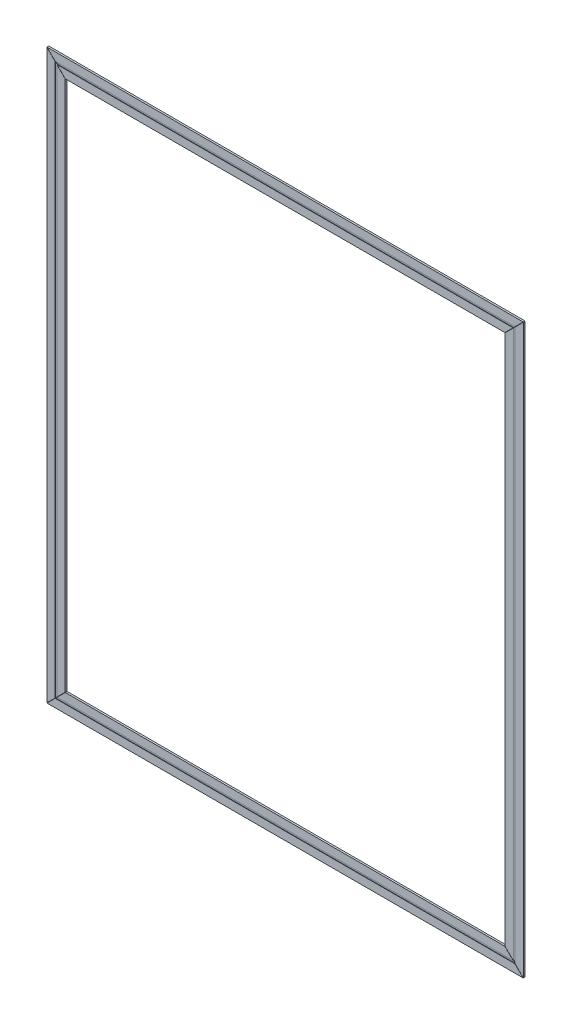
ISO-10303-21;
HEADER;
FILE_DESCRIPTION(('STEP AP214'),'2;1');
FILE_NAME('part.step','',(''),(''),'','','');
FILE_SCHEMA(('AUTOMOTIVE_DESIGN { 1 0 10303 214 1 1 1 1 }'));
ENDSEC;
DATA;
#1=APPLICATION_CONTEXT('core data for automotive mechanical design processes');
#2=APPLICATION_PROTOCOL_DEFINITION('international standard','automotive_design',2000,#1);
#3=PRODUCT_CONTEXT('',#1,'mechanical');
#4=PRODUCT('Part','Part','',(#3));
#5=PRODUCT_RELATED_PRODUCT_CATEGORY('part','',(#4));
#6=PRODUCT_DEFINITION_FORMATION('','',#4);
#7=PRODUCT_DEFINITION_CONTEXT('part definition',#1,'design');
#8=PRODUCT_DEFINITION('design','',#6,#7);
#9=PRODUCT_DEFINITION_SHAPE('','',#8);
#10=(LENGTH_UNIT() NAMED_UNIT(*) SI_UNIT(.MILLI.,.METRE.));
#11=(NAMED_UNIT(*) PLANE_ANGLE_UNIT() SI_UNIT($,.RADIAN.));
#12=(NAMED_UNIT(*) SI_UNIT($,.STERADIAN.) SOLID_ANGLE_UNIT());
#13=UNCERTAINTY_MEASURE_WITH_UNIT(LENGTH_MEASURE(1.E-05),#10,'distance_accuracy_value','');
#14=(GEOMETRIC_REPRESENTATION_CONTEXT(3) GLOBAL_UNCERTAINTY_ASSIGNED_CONTEXT((#13)) GLOBAL_UNIT_ASSIGNED_CONTEXT((#10,
#11,#12)) REPRESENTATION_CONTEXT('',''));
#15=CARTESIAN_POINT('',(0.,0.,0.));
#16=DIRECTION('',(0.,0.,1.));
#17=DIRECTION('',(1.,0.,0.));
#18=AXIS2_PLACEMENT_3D('',#15,#16,#17);
#19=CARTESIAN_POINT('',(0.,0.,2.));
#20=DIRECTION('',(0.,0.,1.));
#21=DIRECTION('',(1.,0.,0.));
#22=AXIS2_PLACEMENT_3D('',#19,#20,#21);
#23=PLANE('',#22);
#24=DIRECTION('',(0.707106781186552,0.707106781186543,0.));
#25=VECTOR('',#24,1.);
#26=CARTESIAN_POINT('',(-259.8,-310.,2.));
#27=LINE('',#26,#25);
#28=CARTESIAN_POINT('',(-259.8,-310.,2.));
#29=VERTEX_POINT('',#28);
#30=CARTESIAN_POINT('',(-250.8,-301.,2.));
#31=VERTEX_POINT('',#30);
#32=EDGE_CURVE('E124',#29,#31,#27,.T.);
#33=ORIENTED_EDGE('',*,*,#32,.F.);
#34=DIRECTION('',(1.,0.,0.));
#35=VECTOR('',#34,1.);
#36=CARTESIAN_POINT('',(0.,-310.,2.));
#37=LINE('',#36,#35);
#38=CARTESIAN_POINT('',(259.8,-310.,2.));
#39=VERTEX_POINT('',#38);
#40=EDGE_CURVE('E136',#29,#39,#37,.T.);
#41=ORIENTED_EDGE('',*,*,#40,.T.);
#42=DIRECTION('',(0.707106781186552,-0.707106781186543,0.));
#43=VECTOR('',#42,1.);
#44=CARTESIAN_POINT('',(259.8,-310.,2.));
#45=LINE('',#44,#43);
#46=CARTESIAN_POINT('',(250.8,-301.,2.));
#47=VERTEX_POINT('',#46);
#48=EDGE_CURVE('E130',#47,#39,#45,.T.);
#49=ORIENTED_EDGE('',*,*,#48,.F.);
#50=DIRECTION('',(-1.,0.,0.));
#51=VECTOR('',#50,1.);
#52=CARTESIAN_POINT('',(0.,-301.,2.));
#53=LINE('',#52,#51);
#54=EDGE_CURVE('E138',#47,#31,#53,.T.);
#55=ORIENTED_EDGE('',*,*,#54,.T.);
#56=EDGE_LOOP('',(#33,#41,#49,#55));
#57=FACE_BOUND('',#56,.T.);
#58=ADVANCED_FACE('F70',(#57),#23,.T.);
#59=CARTESIAN_POINT('',(0.,0.,0.));
#60=DIRECTION('',(0.,0.,1.));
#61=DIRECTION('',(1.,0.,0.));
#62=AXIS2_PLACEMENT_3D('',#59,#60,#61);
#63=PLANE('',#62);
#64=DIRECTION('',(1.,0.,0.));
#65=VECTOR('',#64,1.);
#66=CARTESIAN_POINT('',(0.,-310.,0.));
#67=LINE('',#66,#65);
#68=CARTESIAN_POINT('',(-259.8,-310.,0.));
#69=VERTEX_POINT('',#68);
#70=CARTESIAN_POINT('',(259.8,-310.,0.));
#71=VERTEX_POINT('',#70);
#72=EDGE_CURVE('E151',#69,#71,#67,.T.);
#73=ORIENTED_EDGE('',*,*,#72,.F.);
#74=DIRECTION('',(0.707106781186552,0.707106781186543,0.));
#75=VECTOR('',#74,1.);
#76=CARTESIAN_POINT('',(25.1000000000016,-25.100000000002,0.));
#77=LINE('',#76,#75);
#78=CARTESIAN_POINT('',(-239.8,-290.,0.));
#79=VERTEX_POINT('',#78);
#80=EDGE_CURVE('E89',#69,#79,#77,.T.);
#81=ORIENTED_EDGE('',*,*,#80,.T.);
#82=DIRECTION('',(1.,0.,0.));
#83=VECTOR('',#82,1.);
#84=CARTESIAN_POINT('',(0.,-290.,0.));
#85=LINE('',#84,#83);
#86=CARTESIAN_POINT('',(239.8,-290.,0.));
#87=VERTEX_POINT('',#86);
#88=EDGE_CURVE('E157',#79,#87,#85,.T.);
#89=ORIENTED_EDGE('',*,*,#88,.T.);
#90=DIRECTION('',(0.707106781186552,-0.707106781186543,0.));
#91=VECTOR('',#90,1.);
#92=CARTESIAN_POINT('',(-25.1000000000016,-25.100000000002,0.));
#93=LINE('',#92,#91);
#94=EDGE_CURVE('E152',#87,#71,#93,.T.);
#95=ORIENTED_EDGE('',*,*,#94,.T.);
#96=EDGE_LOOP('',(#73,#81,#89,#95));
#97=FACE_BOUND('',#96,.T.);
#98=ADVANCED_FACE('F72',(#97),#63,.F.);
#99=CARTESIAN_POINT('',(0.,0.,1.5));
#100=DIRECTION('',(0.,0.,1.));
#101=DIRECTION('',(1.,0.,0.));
#102=AXIS2_PLACEMENT_3D('',#99,#100,#101);
#103=PLANE('',#102);
#104=DIRECTION('',(0.707106781186552,0.707106781186543,0.));
#105=VECTOR('',#104,1.);
#106=CARTESIAN_POINT('',(25.1000000000016,-25.100000000002,1.5));
#107=LINE('',#106,#105);
#108=CARTESIAN_POINT('',(-250.8,-301.,1.5));
#109=VERTEX_POINT('',#108);
#110=CARTESIAN_POINT('',(-248.8,-299.,1.5));
#111=VERTEX_POINT('',#110);
#112=EDGE_CURVE('E139',#109,#111,#107,.T.);
#113=ORIENTED_EDGE('',*,*,#112,.F.);
#114=DIRECTION('',(-1.,0.,0.));
#115=VECTOR('',#114,1.);
#116=CARTESIAN_POINT('',(0.,-301.,1.5));
#117=LINE('',#116,#115);
#118=CARTESIAN_POINT('',(250.8,-301.,1.5));
#119=VERTEX_POINT('',#118);
#120=EDGE_CURVE('E153',#119,#109,#117,.T.);
#121=ORIENTED_EDGE('',*,*,#120,.F.);
#122=DIRECTION('',(0.707106781186552,-0.707106781186543,0.));
#123=VECTOR('',#122,1.);
#124=CARTESIAN_POINT('',(-25.1000000000016,-25.100000000002,1.5));
#125=LINE('',#124,#123);
#126=CARTESIAN_POINT('',(248.8,-299.,1.5));
#127=VERTEX_POINT('',#126);
#128=EDGE_CURVE('E179',#127,#119,#125,.T.);
#129=ORIENTED_EDGE('',*,*,#128,.F.);
#130=DIRECTION('',(-1.,0.,0.));
#131=VECTOR('',#130,1.);
#132=CARTESIAN_POINT('',(0.,-299.,1.5));
#133=LINE('',#132,#131);
#134=EDGE_CURVE('E148',#127,#111,#133,.T.);
#135=ORIENTED_EDGE('',*,*,#134,.T.);
#136=EDGE_LOOP('',(#113,#121,#129,#135));
#137=FACE_BOUND('',#136,.T.);
#138=ADVANCED_FACE('F210',(#137),#103,.T.);
#139=CARTESIAN_POINT('',(0.,0.,2.));
#140=DIRECTION('',(0.,0.,1.));
#141=DIRECTION('',(1.,0.,0.));
#142=AXIS2_PLACEMENT_3D('',#139,#140,#141);
#143=PLANE('',#142);
#144=DIRECTION('',(0.707106781186552,0.707106781186543,0.));
#145=VECTOR('',#144,1.);
#146=CARTESIAN_POINT('',(25.1000000000016,-25.100000000002,2.));
#147=LINE('',#146,#145);
#148=CARTESIAN_POINT('',(-248.8,-299.,2.));
#149=VERTEX_POINT('',#148);
#150=CARTESIAN_POINT('',(-239.8,-290.,2.));
#151=VERTEX_POINT('',#150);
#152=EDGE_CURVE('E13',#149,#151,#147,.T.);
#153=ORIENTED_EDGE('',*,*,#152,.F.);
#154=DIRECTION('',(-1.,0.,0.));
#155=VECTOR('',#154,1.);
#156=CARTESIAN_POINT('',(0.,-299.,2.));
#157=LINE('',#156,#155);
#158=CARTESIAN_POINT('',(248.8,-299.,2.));
#159=VERTEX_POINT('',#158);
#160=EDGE_CURVE('E165',#159,#149,#157,.T.);
#161=ORIENTED_EDGE('',*,*,#160,.F.);
#162=CARTESIAN_POINT('',(239.8,-290.,2.));
#163=VERTEX_POINT('',#162);
#164=EDGE_CURVE('E74',#163,#159,#45,.T.);
#165=ORIENTED_EDGE('',*,*,#164,.F.);
#166=DIRECTION('',(1.,0.,0.));
#167=VECTOR('',#166,1.);
#168=CARTESIAN_POINT('',(0.,-290.,2.));
#169=LINE('',#168,#167);
#170=EDGE_CURVE('E160',#151,#163,#169,.T.);
#171=ORIENTED_EDGE('',*,*,#170,.F.);
#172=EDGE_LOOP('',(#153,#161,#165,#171));
#173=FACE_BOUND('',#172,.T.);
#174=ADVANCED_FACE('F199',(#173),#143,.T.);
#175=CARTESIAN_POINT('',(0.,-310.,2.));
#176=DIRECTION('',(0.,1.,0.));
#177=DIRECTION('',(0.,0.,1.));
#178=AXIS2_PLACEMENT_3D('',#175,#176,#177);
#179=PLANE('',#178);
#180=ORIENTED_EDGE('',*,*,#40,.F.);
#181=DIRECTION('',(0.,0.,1.));
#182=VECTOR('',#181,1.);
#183=CARTESIAN_POINT('',(-259.8,-310.,-19.));
#184=LINE('',#183,#182);
#185=EDGE_CURVE('E120',#69,#29,#184,.T.);
#186=ORIENTED_EDGE('',*,*,#185,.F.);
#187=ORIENTED_EDGE('',*,*,#72,.T.);
#188=DIRECTION('',(0.,0.,1.));
#189=VECTOR('',#188,1.);
#190=CARTESIAN_POINT('',(259.8,-310.,-19.));
#191=LINE('',#190,#189);
#192=EDGE_CURVE('E143',#71,#39,#191,.T.);
#193=ORIENTED_EDGE('',*,*,#192,.T.);
#194=EDGE_LOOP('',(#180,#186,#187,#193));
#195=FACE_BOUND('',#194,.T.);
#196=ADVANCED_FACE('F142',(#195),#179,.F.);
#197=CARTESIAN_POINT('',(0.,-301.,2.));
#198=DIRECTION('',(0.,-1.,0.));
#199=DIRECTION('',(0.,0.,-1.));
#200=AXIS2_PLACEMENT_3D('',#197,#198,#199);
#201=PLANE('',#200);
#202=ORIENTED_EDGE('',*,*,#120,.T.);
#203=DIRECTION('',(0.,0.,1.));
#204=VECTOR('',#203,1.);
#205=CARTESIAN_POINT('',(-250.8,-301.,2.));
#206=LINE('',#205,#204);
#207=EDGE_CURVE('E156',#109,#31,#206,.T.);
#208=ORIENTED_EDGE('',*,*,#207,.T.);
#209=ORIENTED_EDGE('',*,*,#54,.F.);
#210=DIRECTION('',(0.,0.,-1.));
#211=VECTOR('',#210,1.);
#212=CARTESIAN_POINT('',(250.8,-301.,2.));
#213=LINE('',#212,#211);
#214=EDGE_CURVE('E168',#47,#119,#213,.T.);
#215=ORIENTED_EDGE('',*,*,#214,.T.);
#216=EDGE_LOOP('',(#202,#208,#209,#215));
#217=FACE_BOUND('',#216,.T.);
#218=ADVANCED_FACE('F203',(#217),#201,.F.);
#219=CARTESIAN_POINT('',(0.,-299.,2.));
#220=DIRECTION('',(0.,-1.,0.));
#221=DIRECTION('',(0.,0.,-1.));
#222=AXIS2_PLACEMENT_3D('',#219,#220,#221);
#223=PLANE('',#222);
#224=DIRECTION('',(0.,0.,1.));
#225=VECTOR('',#224,1.);
#226=CARTESIAN_POINT('',(-248.8,-299.,2.));
#227=LINE('',#226,#225);
#228=EDGE_CURVE('E80',#111,#149,#227,.T.);
#229=ORIENTED_EDGE('',*,*,#228,.F.);
#230=ORIENTED_EDGE('',*,*,#134,.F.);
#231=DIRECTION('',(0.,0.,-1.));
#232=VECTOR('',#231,1.);
#233=CARTESIAN_POINT('',(248.8,-299.,2.));
#234=LINE('',#233,#232);
#235=EDGE_CURVE('E181',#159,#127,#234,.T.);
#236=ORIENTED_EDGE('',*,*,#235,.F.);
#237=ORIENTED_EDGE('',*,*,#160,.T.);
#238=EDGE_LOOP('',(#229,#230,#236,#237));
#239=FACE_BOUND('',#238,.T.);
#240=ADVANCED_FACE('F214',(#239),#223,.T.);
#241=CARTESIAN_POINT('',(0.,-290.,2.));
#242=DIRECTION('',(0.,1.,0.));
#243=DIRECTION('',(0.,0.,1.));
#244=AXIS2_PLACEMENT_3D('',#241,#242,#243);
#245=PLANE('',#244);
#246=DIRECTION('',(0.,0.,1.));
#247=VECTOR('',#246,1.);
#248=CARTESIAN_POINT('',(-239.8,-290.,-19.));
#249=LINE('',#248,#247);
#250=EDGE_CURVE('E164',#79,#151,#249,.T.);
#251=ORIENTED_EDGE('',*,*,#250,.T.);
#252=ORIENTED_EDGE('',*,*,#170,.T.);
#253=DIRECTION('',(0.,0.,1.));
#254=VECTOR('',#253,1.);
#255=CARTESIAN_POINT('',(239.8,-290.,-19.));
#256=LINE('',#255,#254);
#257=EDGE_CURVE('E163',#87,#163,#256,.T.);
#258=ORIENTED_EDGE('',*,*,#257,.F.);
#259=ORIENTED_EDGE('',*,*,#88,.F.);
#260=EDGE_LOOP('',(#251,#252,#258,#259));
#261=FACE_BOUND('',#260,.T.);
#262=ADVANCED_FACE('F194',(#261),#245,.T.);
#263=CARTESIAN_POINT('',(259.8,-310.,-19.));
#264=DIRECTION('',(-0.707106781186543,-0.707106781186552,0.));
#265=DIRECTION('',(0.707106781186552,-0.707106781186543,0.));
#266=AXIS2_PLACEMENT_3D('',#263,#264,#265);
#267=PLANE('',#266);
#268=ORIENTED_EDGE('',*,*,#257,.T.);
#269=ORIENTED_EDGE('',*,*,#164,.T.);
#270=ORIENTED_EDGE('',*,*,#235,.T.);
#271=ORIENTED_EDGE('',*,*,#128,.T.);
#272=ORIENTED_EDGE('',*,*,#214,.F.);
#273=ORIENTED_EDGE('',*,*,#48,.T.);
#274=ORIENTED_EDGE('',*,*,#192,.F.);
#275=ORIENTED_EDGE('',*,*,#94,.F.);
#276=EDGE_LOOP('',(#268,#269,#270,#271,#272,#273,#274,#275));
#277=FACE_BOUND('',#276,.T.);
#278=ADVANCED_FACE('F190',(#277),#267,.F.);
#279=CARTESIAN_POINT('',(-259.8,-310.,-19.));
#280=DIRECTION('',(0.707106781186543,-0.707106781186552,0.));
#281=DIRECTION('',(0.707106781186552,0.707106781186543,0.));
#282=AXIS2_PLACEMENT_3D('',#279,#280,#281);
#283=PLANE('',#282);
#284=ORIENTED_EDGE('',*,*,#185,.T.);
#285=ORIENTED_EDGE('',*,*,#32,.T.);
#286=ORIENTED_EDGE('',*,*,#207,.F.);
#287=ORIENTED_EDGE('',*,*,#112,.T.);
#288=ORIENTED_EDGE('',*,*,#228,.T.);
#289=ORIENTED_EDGE('',*,*,#152,.T.);
#290=ORIENTED_EDGE('',*,*,#250,.F.);
#291=ORIENTED_EDGE('',*,*,#80,.F.);
#292=EDGE_LOOP('',(#284,#285,#286,#287,#288,#289,#290,#291));
#293=FACE_BOUND('',#292,.T.);
#294=ADVANCED_FACE('F122',(#293),#283,.F.);
#295=CLOSED_SHELL('',(#58,#98,#138,#174,#196,#218,#240,#262,#278,#294));
#296=MANIFOLD_SOLID_BREP('B2',#295);
#297=CARTESIAN_POINT('',(0.,0.,2.));
#298=DIRECTION('',(0.,0.,1.));
#299=DIRECTION('',(1.,0.,0.));
#300=AXIS2_PLACEMENT_3D('',#297,#298,#299);
#301=PLANE('',#300);
#302=DIRECTION('',(-0.707106781186551,-0.707106781186544,0.));
#303=VECTOR('',#302,1.);
#304=CARTESIAN_POINT('',(259.8,310.,2.));
#305=LINE('',#304,#303);
#306=CARTESIAN_POINT('',(259.8,310.,2.));
#307=VERTEX_POINT('',#306);
#308=CARTESIAN_POINT('',(250.8,301.,2.));
#309=VERTEX_POINT('',#308);
#310=EDGE_CURVE('E394',#307,#309,#305,.T.);
#311=ORIENTED_EDGE('',*,*,#310,.F.);
#312=DIRECTION('',(1.,0.,0.));
#313=VECTOR('',#312,1.);
#314=CARTESIAN_POINT('',(0.,310.,2.));
#315=LINE('',#314,#313);
#316=CARTESIAN_POINT('',(-259.8,310.,2.));
#317=VERTEX_POINT('',#316);
#318=EDGE_CURVE('E511',#317,#307,#315,.T.);
#319=ORIENTED_EDGE('',*,*,#318,.F.);
#320=DIRECTION('',(-0.707106781186551,0.707106781186544,0.));
#321=VECTOR('',#320,1.);
#322=CARTESIAN_POINT('',(-259.8,310.,2.));
#323=LINE('',#322,#321);
#324=CARTESIAN_POINT('',(-250.8,301.,2.));
#325=VERTEX_POINT('',#324);
#326=EDGE_CURVE('E499',#325,#317,#323,.T.);
#327=ORIENTED_EDGE('',*,*,#326,.F.);
#328=DIRECTION('',(-1.,0.,0.));
#329=VECTOR('',#328,1.);
#330=CARTESIAN_POINT('',(0.,301.,2.));
#331=LINE('',#330,#329);
#332=EDGE_CURVE('E508',#309,#325,#331,.T.);
#333=ORIENTED_EDGE('',*,*,#332,.F.);
#334=EDGE_LOOP('',(#311,#319,#327,#333));
#335=FACE_BOUND('',#334,.T.);
#336=ADVANCED_FACE('F391',(#335),#301,.T.);
#337=CARTESIAN_POINT('',(0.,0.,2.));
#338=DIRECTION('',(0.,0.,1.));
#339=DIRECTION('',(1.,0.,0.));
#340=AXIS2_PLACEMENT_3D('',#337,#338,#339);
#341=PLANE('',#340);
#342=DIRECTION('',(-0.707106781186551,-0.707106781186544,0.));
#343=VECTOR('',#342,1.);
#344=CARTESIAN_POINT('',(-25.1000000000014,25.1000000000016,2.));
#345=LINE('',#344,#343);
#346=CARTESIAN_POINT('',(248.8,299.,2.));
#347=VERTEX_POINT('',#346);
#348=CARTESIAN_POINT('',(239.8,290.,2.));
#349=VERTEX_POINT('',#348);
#350=EDGE_CURVE('E68',#347,#349,#345,.T.);
#351=ORIENTED_EDGE('',*,*,#350,.F.);
#352=DIRECTION('',(-1.,0.,0.));
#353=VECTOR('',#352,1.);
#354=CARTESIAN_POINT('',(0.,299.,2.));
#355=LINE('',#354,#353);
#356=CARTESIAN_POINT('',(-248.8,299.,2.));
#357=VERTEX_POINT('',#356);
#358=EDGE_CURVE('E489',#347,#357,#355,.T.);
#359=ORIENTED_EDGE('',*,*,#358,.T.);
#360=CARTESIAN_POINT('',(-239.8,290.,2.));
#361=VERTEX_POINT('',#360);
#362=EDGE_CURVE('E502',#361,#357,#323,.T.);
#363=ORIENTED_EDGE('',*,*,#362,.F.);
#364=DIRECTION('',(1.,0.,0.));
#365=VECTOR('',#364,1.);
#366=CARTESIAN_POINT('',(0.,290.,2.));
#367=LINE('',#366,#365);
#368=EDGE_CURVE('E486',#361,#349,#367,.T.);
#369=ORIENTED_EDGE('',*,*,#368,.T.);
#370=EDGE_LOOP('',(#351,#359,#363,#369));
#371=FACE_BOUND('',#370,.T.);
#372=ADVANCED_FACE('F525',(#371),#341,.T.);
#373=CARTESIAN_POINT('',(0.,299.,2.));
#374=DIRECTION('',(0.,-1.,0.));
#375=DIRECTION('',(0.,0.,-1.));
#376=AXIS2_PLACEMENT_3D('',#373,#374,#375);
#377=PLANE('',#376);
#378=ORIENTED_EDGE('',*,*,#358,.F.);
#379=DIRECTION('',(0.,0.,-1.));
#380=VECTOR('',#379,1.);
#381=CARTESIAN_POINT('',(248.8,299.,2.));
#382=LINE('',#381,#380);
#383=CARTESIAN_POINT('',(248.8,299.,1.5));
#384=VERTEX_POINT('',#383);
#385=EDGE_CURVE('E448',#347,#384,#382,.T.);
#386=ORIENTED_EDGE('',*,*,#385,.T.);
#387=DIRECTION('',(-1.,0.,0.));
#388=VECTOR('',#387,1.);
#389=CARTESIAN_POINT('',(0.,299.,1.5));
#390=LINE('',#389,#388);
#391=CARTESIAN_POINT('',(-248.8,299.,1.5));
#392=VERTEX_POINT('',#391);
#393=EDGE_CURVE('E469',#384,#392,#390,.T.);
#394=ORIENTED_EDGE('',*,*,#393,.T.);
#395=DIRECTION('',(0.,0.,1.));
#396=VECTOR('',#395,1.);
#397=CARTESIAN_POINT('',(-248.8,299.,2.));
#398=LINE('',#397,#396);
#399=EDGE_CURVE('E485',#392,#357,#398,.T.);
#400=ORIENTED_EDGE('',*,*,#399,.T.);
#401=EDGE_LOOP('',(#378,#386,#394,#400));
#402=FACE_BOUND('',#401,.T.);
#403=ADVANCED_FACE('F529',(#402),#377,.F.);
#404=CARTESIAN_POINT('',(0.,290.,2.));
#405=DIRECTION('',(0.,1.,0.));
#406=DIRECTION('',(0.,0.,1.));
#407=AXIS2_PLACEMENT_3D('',#404,#405,#406);
#408=PLANE('',#407);
#409=DIRECTION('',(1.,0.,0.));
#410=VECTOR('',#409,1.);
#411=CARTESIAN_POINT('',(0.,290.,0.));
#412=LINE('',#411,#410);
#413=CARTESIAN_POINT('',(-239.8,290.,0.));
#414=VERTEX_POINT('',#413);
#415=CARTESIAN_POINT('',(239.8,290.,0.));
#416=VERTEX_POINT('',#415);
#417=EDGE_CURVE('E479',#414,#416,#412,.T.);
#418=ORIENTED_EDGE('',*,*,#417,.T.);
#419=DIRECTION('',(0.,0.,1.));
#420=VECTOR('',#419,1.);
#421=CARTESIAN_POINT('',(239.8,290.,-19.));
#422=LINE('',#421,#420);
#423=EDGE_CURVE('E475',#416,#349,#422,.T.);
#424=ORIENTED_EDGE('',*,*,#423,.T.);
#425=ORIENTED_EDGE('',*,*,#368,.F.);
#426=DIRECTION('',(0.,0.,1.));
#427=VECTOR('',#426,1.);
#428=CARTESIAN_POINT('',(-239.8,290.,-19.));
#429=LINE('',#428,#427);
#430=EDGE_CURVE('E505',#414,#361,#429,.T.);
#431=ORIENTED_EDGE('',*,*,#430,.F.);
#432=EDGE_LOOP('',(#418,#424,#425,#431));
#433=FACE_BOUND('',#432,.T.);
#434=ADVANCED_FACE('F535',(#433),#408,.F.);
#435=CARTESIAN_POINT('',(0.,0.,1.5));
#436=DIRECTION('',(0.,0.,1.));
#437=DIRECTION('',(1.,0.,0.));
#438=AXIS2_PLACEMENT_3D('',#435,#436,#437);
#439=PLANE('',#438);
#440=DIRECTION('',(-0.707106781186551,-0.707106781186544,0.));
#441=VECTOR('',#440,1.);
#442=CARTESIAN_POINT('',(-25.1000000000014,25.1000000000016,1.5));
#443=LINE('',#442,#441);
#444=CARTESIAN_POINT('',(250.8,301.,1.5));
#445=VERTEX_POINT('',#444);
#446=EDGE_CURVE('E400',#445,#384,#443,.T.);
#447=ORIENTED_EDGE('',*,*,#446,.F.);
#448=DIRECTION('',(-1.,0.,0.));
#449=VECTOR('',#448,1.);
#450=CARTESIAN_POINT('',(0.,301.,1.5));
#451=LINE('',#450,#449);
#452=CARTESIAN_POINT('',(-250.8,301.,1.5));
#453=VERTEX_POINT('',#452);
#454=EDGE_CURVE('E467',#445,#453,#451,.T.);
#455=ORIENTED_EDGE('',*,*,#454,.T.);
#456=DIRECTION('',(-0.707106781186551,0.707106781186544,0.));
#457=VECTOR('',#456,1.);
#458=CARTESIAN_POINT('',(25.1000000000014,25.1000000000016,1.5));
#459=LINE('',#458,#457);
#460=EDGE_CURVE('E500',#392,#453,#459,.T.);
#461=ORIENTED_EDGE('',*,*,#460,.F.);
#462=ORIENTED_EDGE('',*,*,#393,.F.);
#463=EDGE_LOOP('',(#447,#455,#461,#462));
#464=FACE_BOUND('',#463,.T.);
#465=ADVANCED_FACE('F465',(#464),#439,.T.);
#466=CARTESIAN_POINT('',(0.,0.,0.));
#467=DIRECTION('',(0.,0.,1.));
#468=DIRECTION('',(1.,0.,0.));
#469=AXIS2_PLACEMENT_3D('',#466,#467,#468);
#470=PLANE('',#469);
#471=DIRECTION('',(1.,0.,0.));
#472=VECTOR('',#471,1.);
#473=CARTESIAN_POINT('',(0.,310.,0.));
#474=LINE('',#473,#472);
#475=CARTESIAN_POINT('',(-259.8,310.,0.));
#476=VERTEX_POINT('',#475);
#477=CARTESIAN_POINT('',(259.8,310.,0.));
#478=VERTEX_POINT('',#477);
#479=EDGE_CURVE('E474',#476,#478,#474,.T.);
#480=ORIENTED_EDGE('',*,*,#479,.T.);
#481=DIRECTION('',(-0.707106781186551,-0.707106781186544,0.));
#482=VECTOR('',#481,1.);
#483=CARTESIAN_POINT('',(-25.1000000000014,25.1000000000016,0.));
#484=LINE('',#483,#482);
#485=EDGE_CURVE('E409',#478,#416,#484,.T.);
#486=ORIENTED_EDGE('',*,*,#485,.T.);
#487=ORIENTED_EDGE('',*,*,#417,.F.);
#488=DIRECTION('',(-0.707106781186551,0.707106781186544,0.));
#489=VECTOR('',#488,1.);
#490=CARTESIAN_POINT('',(25.1000000000014,25.1000000000016,0.));
#491=LINE('',#490,#489);
#492=EDGE_CURVE('E492',#414,#476,#491,.T.);
#493=ORIENTED_EDGE('',*,*,#492,.T.);
#494=EDGE_LOOP('',(#480,#486,#487,#493));
#495=FACE_BOUND('',#494,.T.);
#496=ADVANCED_FACE('F542',(#495),#470,.F.);
#497=CARTESIAN_POINT('',(0.,310.,2.));
#498=DIRECTION('',(0.,1.,0.));
#499=DIRECTION('',(0.,0.,1.));
#500=AXIS2_PLACEMENT_3D('',#497,#498,#499);
#501=PLANE('',#500);
#502=DIRECTION('',(0.,0.,1.));
#503=VECTOR('',#502,1.);
#504=CARTESIAN_POINT('',(259.8,310.,-19.));
#505=LINE('',#504,#503);
#506=EDGE_CURVE('E513',#478,#307,#505,.T.);
#507=ORIENTED_EDGE('',*,*,#506,.F.);
#508=ORIENTED_EDGE('',*,*,#479,.F.);
#509=DIRECTION('',(0.,0.,1.));
#510=VECTOR('',#509,1.);
#511=CARTESIAN_POINT('',(-259.8,310.,-19.));
#512=LINE('',#511,#510);
#513=EDGE_CURVE('E497',#476,#317,#512,.T.);
#514=ORIENTED_EDGE('',*,*,#513,.T.);
#515=ORIENTED_EDGE('',*,*,#318,.T.);
#516=EDGE_LOOP('',(#507,#508,#514,#515));
#517=FACE_BOUND('',#516,.T.);
#518=ADVANCED_FACE('F522',(#517),#501,.T.);
#519=CARTESIAN_POINT('',(0.,301.,2.));
#520=DIRECTION('',(0.,-1.,0.));
#521=DIRECTION('',(0.,0.,-1.));
#522=AXIS2_PLACEMENT_3D('',#519,#520,#521);
#523=PLANE('',#522);
#524=DIRECTION('',(0.,0.,-1.));
#525=VECTOR('',#524,1.);
#526=CARTESIAN_POINT('',(250.8,301.,2.));
#527=LINE('',#526,#525);
#528=EDGE_CURVE('E453',#309,#445,#527,.T.);
#529=ORIENTED_EDGE('',*,*,#528,.F.);
#530=ORIENTED_EDGE('',*,*,#332,.T.);
#531=DIRECTION('',(0.,0.,1.));
#532=VECTOR('',#531,1.);
#533=CARTESIAN_POINT('',(-250.8,301.,2.));
#534=LINE('',#533,#532);
#535=EDGE_CURVE('E473',#453,#325,#534,.T.);
#536=ORIENTED_EDGE('',*,*,#535,.F.);
#537=ORIENTED_EDGE('',*,*,#454,.F.);
#538=EDGE_LOOP('',(#529,#530,#536,#537));
#539=FACE_BOUND('',#538,.T.);
#540=ADVANCED_FACE('F472',(#539),#523,.T.);
#541=CARTESIAN_POINT('',(-259.8,310.,-19.));
#542=DIRECTION('',(0.707106781186544,0.707106781186551,0.));
#543=DIRECTION('',(-0.707106781186551,0.707106781186544,0.));
#544=AXIS2_PLACEMENT_3D('',#541,#542,#543);
#545=PLANE('',#544);
#546=ORIENTED_EDGE('',*,*,#430,.T.);
#547=ORIENTED_EDGE('',*,*,#362,.T.);
#548=ORIENTED_EDGE('',*,*,#399,.F.);
#549=ORIENTED_EDGE('',*,*,#460,.T.);
#550=ORIENTED_EDGE('',*,*,#535,.T.);
#551=ORIENTED_EDGE('',*,*,#326,.T.);
#552=ORIENTED_EDGE('',*,*,#513,.F.);
#553=ORIENTED_EDGE('',*,*,#492,.F.);
#554=EDGE_LOOP('',(#546,#547,#548,#549,#550,#551,#552,#553));
#555=FACE_BOUND('',#554,.T.);
#556=ADVANCED_FACE('F516',(#555),#545,.F.);
#557=CARTESIAN_POINT('',(259.8,310.,-19.));
#558=DIRECTION('',(-0.707106781186544,0.707106781186551,0.));
#559=DIRECTION('',(-0.707106781186551,-0.707106781186544,0.));
#560=AXIS2_PLACEMENT_3D('',#557,#558,#559);
#561=PLANE('',#560);
#562=ORIENTED_EDGE('',*,*,#506,.T.);
#563=ORIENTED_EDGE('',*,*,#310,.T.);
#564=ORIENTED_EDGE('',*,*,#528,.T.);
#565=ORIENTED_EDGE('',*,*,#446,.T.);
#566=ORIENTED_EDGE('',*,*,#385,.F.);
#567=ORIENTED_EDGE('',*,*,#350,.T.);
#568=ORIENTED_EDGE('',*,*,#423,.F.);
#569=ORIENTED_EDGE('',*,*,#485,.F.);
#570=EDGE_LOOP('',(#562,#563,#564,#565,#566,#567,#568,#569));
#571=FACE_BOUND('',#570,.T.);
#572=ADVANCED_FACE('F455',(#571),#561,.F.);
#573=CLOSED_SHELL('',(#336,#372,#403,#434,#465,#496,#518,#540,#556,#572));
#574=MANIFOLD_SOLID_BREP('B7',#573);
#575=CARTESIAN_POINT('',(0.,0.,2.));
#576=DIRECTION('',(0.,0.,1.));
#577=DIRECTION('',(1.,0.,0.));
#578=AXIS2_PLACEMENT_3D('',#575,#576,#577);
#579=PLANE('',#578);
#580=DIRECTION('',(-0.707106781186551,-0.707106781186544,0.));
#581=VECTOR('',#580,1.);
#582=CARTESIAN_POINT('',(-240.,-289.8,2.));
#583=LINE('',#582,#581);
#584=CARTESIAN_POINT('',(-240.,-289.8,2.));
#585=VERTEX_POINT('',#584);
#586=CARTESIAN_POINT('',(-249.,-298.8,2.));
#587=VERTEX_POINT('',#586);
#588=EDGE_CURVE('E715',#585,#587,#583,.T.);
#589=ORIENTED_EDGE('',*,*,#588,.F.);
#590=DIRECTION('',(0.,1.,0.));
#591=VECTOR('',#590,1.);
#592=CARTESIAN_POINT('',(-240.,0.,2.));
#593=LINE('',#592,#591);
#594=CARTESIAN_POINT('',(-240.,289.8,2.));
#595=VERTEX_POINT('',#594);
#596=EDGE_CURVE('E800',#585,#595,#593,.T.);
#597=ORIENTED_EDGE('',*,*,#596,.T.);
#598=DIRECTION('',(0.707106781186551,-0.707106781186544,0.));
#599=VECTOR('',#598,1.);
#600=CARTESIAN_POINT('',(24.9000000000012,24.9000000000015,2.));
#601=LINE('',#600,#599);
#602=CARTESIAN_POINT('',(-249.,298.8,2.));
#603=VERTEX_POINT('',#602);
#604=EDGE_CURVE('E818',#603,#595,#601,.T.);
#605=ORIENTED_EDGE('',*,*,#604,.F.);
#606=DIRECTION('',(0.,-1.,0.));
#607=VECTOR('',#606,1.);
#608=CARTESIAN_POINT('',(-249.,0.,2.));
#609=LINE('',#608,#607);
#610=EDGE_CURVE('E791',#603,#587,#609,.T.);
#611=ORIENTED_EDGE('',*,*,#610,.T.);
#612=EDGE_LOOP('',(#589,#597,#605,#611));
#613=FACE_BOUND('',#612,.T.);
#614=ADVANCED_FACE('F711',(#613),#579,.T.);
#615=CARTESIAN_POINT('',(-249.,0.,2.));
#616=DIRECTION('',(1.,0.,0.));
#617=DIRECTION('',(0.,0.,-1.));
#618=AXIS2_PLACEMENT_3D('',#615,#616,#617);
#619=PLANE('',#618);
#620=DIRECTION('',(0.,-1.,0.));
#621=VECTOR('',#620,1.);
#622=CARTESIAN_POINT('',(-249.,0.,1.5));
#623=LINE('',#622,#621);
#624=CARTESIAN_POINT('',(-249.,298.8,1.5));
#625=VERTEX_POINT('',#624);
#626=CARTESIAN_POINT('',(-249.,-298.8,1.5));
#627=VERTEX_POINT('',#626);
#628=EDGE_CURVE('E787',#625,#627,#623,.T.);
#629=ORIENTED_EDGE('',*,*,#628,.T.);
#630=DIRECTION('',(0.,0.,1.));
#631=VECTOR('',#630,1.);
#632=CARTESIAN_POINT('',(-249.,-298.8,2.));
#633=LINE('',#632,#631);
#634=EDGE_CURVE('E790',#627,#587,#633,.T.);
#635=ORIENTED_EDGE('',*,*,#634,.T.);
#636=ORIENTED_EDGE('',*,*,#610,.F.);
#637=DIRECTION('',(0.,0.,-1.));
#638=VECTOR('',#637,1.);
#639=CARTESIAN_POINT('',(-249.,298.8,2.));
#640=LINE('',#639,#638);
#641=EDGE_CURVE('E799',#603,#625,#640,.T.);
#642=ORIENTED_EDGE('',*,*,#641,.T.);
#643=EDGE_LOOP('',(#629,#635,#636,#642));
#644=FACE_BOUND('',#643,.T.);
#645=ADVANCED_FACE('F843',(#644),#619,.F.);
#646=CARTESIAN_POINT('',(-240.,0.,2.));
#647=DIRECTION('',(-1.,0.,0.));
#648=DIRECTION('',(0.,0.,1.));
#649=AXIS2_PLACEMENT_3D('',#646,#647,#648);
#650=PLANE('',#649);
#651=ORIENTED_EDGE('',*,*,#596,.F.);
#652=DIRECTION('',(0.,0.,1.));
#653=VECTOR('',#652,1.);
#654=CARTESIAN_POINT('',(-240.,-289.8,-19.));
#655=LINE('',#654,#653);
#656=CARTESIAN_POINT('',(-240.,-289.8,0.));
#657=VERTEX_POINT('',#656);
#658=EDGE_CURVE('E823',#657,#585,#655,.T.);
#659=ORIENTED_EDGE('',*,*,#658,.F.);
#660=DIRECTION('',(0.,1.,0.));
#661=VECTOR('',#660,1.);
#662=CARTESIAN_POINT('',(-240.,0.,0.));
#663=LINE('',#662,#661);
#664=CARTESIAN_POINT('',(-240.,289.8,0.));
#665=VERTEX_POINT('',#664);
#666=EDGE_CURVE('E796',#657,#665,#663,.T.);
#667=ORIENTED_EDGE('',*,*,#666,.T.);
#668=DIRECTION('',(0.,0.,1.));
#669=VECTOR('',#668,1.);
#670=CARTESIAN_POINT('',(-240.,289.8,-19.));
#671=LINE('',#670,#669);
#672=EDGE_CURVE('E795',#665,#595,#671,.T.);
#673=ORIENTED_EDGE('',*,*,#672,.T.);
#674=EDGE_LOOP('',(#651,#659,#667,#673));
#675=FACE_BOUND('',#674,.T.);
#676=ADVANCED_FACE('F834',(#675),#650,.F.);
#677=CARTESIAN_POINT('',(0.,0.,1.5));
#678=DIRECTION('',(0.,0.,1.));
#679=DIRECTION('',(1.,0.,0.));
#680=AXIS2_PLACEMENT_3D('',#677,#678,#679);
#681=PLANE('',#680);
#682=DIRECTION('',(-0.707106781186551,-0.707106781186544,0.));
#683=VECTOR('',#682,1.);
#684=CARTESIAN_POINT('',(24.9000000000015,-24.9000000000018,1.5));
#685=LINE('',#684,#683);
#686=CARTESIAN_POINT('',(-251.,-300.8,1.5));
#687=VERTEX_POINT('',#686);
#688=EDGE_CURVE('E809',#627,#687,#685,.T.);
#689=ORIENTED_EDGE('',*,*,#688,.F.);
#690=ORIENTED_EDGE('',*,*,#628,.F.);
#691=DIRECTION('',(0.707106781186551,-0.707106781186544,0.));
#692=VECTOR('',#691,1.);
#693=CARTESIAN_POINT('',(24.9000000000012,24.9000000000015,1.5));
#694=LINE('',#693,#692);
#695=CARTESIAN_POINT('',(-251.,300.8,1.5));
#696=VERTEX_POINT('',#695);
#697=EDGE_CURVE('E816',#696,#625,#694,.T.);
#698=ORIENTED_EDGE('',*,*,#697,.F.);
#699=DIRECTION('',(0.,-1.,0.));
#700=VECTOR('',#699,1.);
#701=CARTESIAN_POINT('',(-251.,0.,1.5));
#702=LINE('',#701,#700);
#703=EDGE_CURVE('E792',#696,#687,#702,.T.);
#704=ORIENTED_EDGE('',*,*,#703,.T.);
#705=EDGE_LOOP('',(#689,#690,#698,#704));
#706=FACE_BOUND('',#705,.T.);
#707=ADVANCED_FACE('F849',(#706),#681,.T.);
#708=CARTESIAN_POINT('',(0.,0.,0.));
#709=DIRECTION('',(0.,0.,1.));
#710=DIRECTION('',(1.,0.,0.));
#711=AXIS2_PLACEMENT_3D('',#708,#709,#710);
#712=PLANE('',#711);
#713=ORIENTED_EDGE('',*,*,#666,.F.);
#714=DIRECTION('',(-0.707106781186551,-0.707106781186544,0.));
#715=VECTOR('',#714,1.);
#716=CARTESIAN_POINT('',(24.9000000000015,-24.9000000000018,0.));
#717=LINE('',#716,#715);
#718=CARTESIAN_POINT('',(-260.,-309.8,0.));
#719=VERTEX_POINT('',#718);
#720=EDGE_CURVE('E729',#657,#719,#717,.T.);
#721=ORIENTED_EDGE('',*,*,#720,.T.);
#722=DIRECTION('',(0.,1.,0.));
#723=VECTOR('',#722,1.);
#724=CARTESIAN_POINT('',(-260.,0.,0.));
#725=LINE('',#724,#723);
#726=CARTESIAN_POINT('',(-260.,309.8,0.));
#727=VERTEX_POINT('',#726);
#728=EDGE_CURVE('E806',#719,#727,#725,.T.);
#729=ORIENTED_EDGE('',*,*,#728,.T.);
#730=DIRECTION('',(0.707106781186551,-0.707106781186544,0.));
#731=VECTOR('',#730,1.);
#732=CARTESIAN_POINT('',(24.9000000000012,24.9000000000015,0.));
#733=LINE('',#732,#731);
#734=EDGE_CURVE('E765',#727,#665,#733,.T.);
#735=ORIENTED_EDGE('',*,*,#734,.T.);
#736=EDGE_LOOP('',(#713,#721,#729,#735));
#737=FACE_BOUND('',#736,.T.);
#738=ADVANCED_FACE('F831',(#737),#712,.F.);
#739=CARTESIAN_POINT('',(0.,0.,2.));
#740=DIRECTION('',(0.,0.,1.));
#741=DIRECTION('',(1.,0.,0.));
#742=AXIS2_PLACEMENT_3D('',#739,#740,#741);
#743=PLANE('',#742);
#744=CARTESIAN_POINT('',(-251.,-300.8,2.));
#745=VERTEX_POINT('',#744);
#746=CARTESIAN_POINT('',(-260.,-309.8,2.));
#747=VERTEX_POINT('',#746);
#748=EDGE_CURVE('E389',#745,#747,#583,.T.);
#749=ORIENTED_EDGE('',*,*,#748,.F.);
#750=DIRECTION('',(0.,-1.,0.));
#751=VECTOR('',#750,1.);
#752=CARTESIAN_POINT('',(-251.,0.,2.));
#753=LINE('',#752,#751);
#754=CARTESIAN_POINT('',(-251.,300.8,2.));
#755=VERTEX_POINT('',#754);
#756=EDGE_CURVE('E770',#755,#745,#753,.T.);
#757=ORIENTED_EDGE('',*,*,#756,.F.);
#758=DIRECTION('',(0.707106781186551,-0.707106781186544,0.));
#759=VECTOR('',#758,1.);
#760=CARTESIAN_POINT('',(-240.,289.8,2.));
#761=LINE('',#760,#759);
#762=CARTESIAN_POINT('',(-260.,309.8,2.));
#763=VERTEX_POINT('',#762);
#764=EDGE_CURVE('E762',#763,#755,#761,.T.);
#765=ORIENTED_EDGE('',*,*,#764,.F.);
#766=DIRECTION('',(0.,1.,0.));
#767=VECTOR('',#766,1.);
#768=CARTESIAN_POINT('',(-260.,0.,2.));
#769=LINE('',#768,#767);
#770=EDGE_CURVE('E776',#747,#763,#769,.T.);
#771=ORIENTED_EDGE('',*,*,#770,.F.);
#772=EDGE_LOOP('',(#749,#757,#765,#771));
#773=FACE_BOUND('',#772,.T.);
#774=ADVANCED_FACE('F713',(#773),#743,.T.);
#775=CARTESIAN_POINT('',(-260.,0.,2.));
#776=DIRECTION('',(-1.,0.,0.));
#777=DIRECTION('',(0.,0.,1.));
#778=AXIS2_PLACEMENT_3D('',#775,#776,#777);
#779=PLANE('',#778);
#780=DIRECTION('',(0.,0.,1.));
#781=VECTOR('',#780,1.);
#782=CARTESIAN_POINT('',(-260.,-309.8,-19.));
#783=LINE('',#782,#781);
#784=EDGE_CURVE('E782',#719,#747,#783,.T.);
#785=ORIENTED_EDGE('',*,*,#784,.T.);
#786=ORIENTED_EDGE('',*,*,#770,.T.);
#787=DIRECTION('',(0.,0.,1.));
#788=VECTOR('',#787,1.);
#789=CARTESIAN_POINT('',(-260.,309.8,-19.));
#790=LINE('',#789,#788);
#791=EDGE_CURVE('E759',#727,#763,#790,.T.);
#792=ORIENTED_EDGE('',*,*,#791,.F.);
#793=ORIENTED_EDGE('',*,*,#728,.F.);
#794=EDGE_LOOP('',(#785,#786,#792,#793));
#795=FACE_BOUND('',#794,.T.);
#796=ADVANCED_FACE('F781',(#795),#779,.T.);
#797=CARTESIAN_POINT('',(-251.,0.,2.));
#798=DIRECTION('',(1.,0.,0.));
#799=DIRECTION('',(0.,0.,-1.));
#800=AXIS2_PLACEMENT_3D('',#797,#798,#799);
#801=PLANE('',#800);
#802=DIRECTION('',(0.,0.,1.));
#803=VECTOR('',#802,1.);
#804=CARTESIAN_POINT('',(-251.,-300.8,2.));
#805=LINE('',#804,#803);
#806=EDGE_CURVE('E721',#687,#745,#805,.T.);
#807=ORIENTED_EDGE('',*,*,#806,.F.);
#808=ORIENTED_EDGE('',*,*,#703,.F.);
#809=DIRECTION('',(0.,0.,-1.));
#810=VECTOR('',#809,1.);
#811=CARTESIAN_POINT('',(-251.,300.8,2.));
#812=LINE('',#811,#810);
#813=EDGE_CURVE('E778',#755,#696,#812,.T.);
#814=ORIENTED_EDGE('',*,*,#813,.F.);
#815=ORIENTED_EDGE('',*,*,#756,.T.);
#816=EDGE_LOOP('',(#807,#808,#814,#815));
#817=FACE_BOUND('',#816,.T.);
#818=ADVANCED_FACE('F855',(#817),#801,.T.);
#819=CARTESIAN_POINT('',(-240.,289.8,-19.));
#820=DIRECTION('',(-0.707106781186544,-0.707106781186551,0.));
#821=DIRECTION('',(0.707106781186551,-0.707106781186544,0.));
#822=AXIS2_PLACEMENT_3D('',#819,#820,#821);
#823=PLANE('',#822);
#824=ORIENTED_EDGE('',*,*,#791,.T.);
#825=ORIENTED_EDGE('',*,*,#764,.T.);
#826=ORIENTED_EDGE('',*,*,#813,.T.);
#827=ORIENTED_EDGE('',*,*,#697,.T.);
#828=ORIENTED_EDGE('',*,*,#641,.F.);
#829=ORIENTED_EDGE('',*,*,#604,.T.);
#830=ORIENTED_EDGE('',*,*,#672,.F.);
#831=ORIENTED_EDGE('',*,*,#734,.F.);
#832=EDGE_LOOP('',(#824,#825,#826,#827,#828,#829,#830,#831));
#833=FACE_BOUND('',#832,.T.);
#834=ADVANCED_FACE('F761',(#833),#823,.F.);
#835=CARTESIAN_POINT('',(-240.,-289.8,-19.));
#836=DIRECTION('',(-0.707106781186544,0.707106781186551,0.));
#837=DIRECTION('',(-0.707106781186551,-0.707106781186544,0.));
#838=AXIS2_PLACEMENT_3D('',#835,#836,#837);
#839=PLANE('',#838);
#840=ORIENTED_EDGE('',*,*,#658,.T.);
#841=ORIENTED_EDGE('',*,*,#588,.T.);
#842=ORIENTED_EDGE('',*,*,#634,.F.);
#843=ORIENTED_EDGE('',*,*,#688,.T.);
#844=ORIENTED_EDGE('',*,*,#806,.T.);
#845=ORIENTED_EDGE('',*,*,#748,.T.);
#846=ORIENTED_EDGE('',*,*,#784,.F.);
#847=ORIENTED_EDGE('',*,*,#720,.F.);
#848=EDGE_LOOP('',(#840,#841,#842,#843,#844,#845,#846,#847));
#849=FACE_BOUND('',#848,.T.);
#850=ADVANCED_FACE('F839',(#849),#839,.F.);
#851=CLOSED_SHELL('',(#614,#645,#676,#707,#738,#774,#796,#818,#834,#850));
#852=MANIFOLD_SOLID_BREP('B62',#851);
#853=CARTESIAN_POINT('',(0.,0.,2.));
#854=DIRECTION('',(0.,0.,1.));
#855=DIRECTION('',(1.,0.,0.));
#856=AXIS2_PLACEMENT_3D('',#853,#854,#855);
#857=PLANE('',#856);
#858=DIRECTION('',(-0.707106781186551,0.707106781186544,0.));
#859=VECTOR('',#858,1.);
#860=CARTESIAN_POINT('',(-24.9000000000015,-24.9000000000018,2.));
#861=LINE('',#860,#859);
#862=CARTESIAN_POINT('',(249.,-298.8,2.));
#863=VERTEX_POINT('',#862);
#864=CARTESIAN_POINT('',(240.,-289.8,2.));
#865=VERTEX_POINT('',#864);
#866=EDGE_CURVE('E709',#863,#865,#861,.T.);
#867=ORIENTED_EDGE('',*,*,#866,.F.);
#868=DIRECTION('',(0.,-1.,0.));
#869=VECTOR('',#868,1.);
#870=CARTESIAN_POINT('',(249.,0.,2.));
#871=LINE('',#870,#869);
#872=CARTESIAN_POINT('',(249.,298.8,2.));
#873=VERTEX_POINT('',#872);
#874=EDGE_CURVE('E1123',#873,#863,#871,.T.);
#875=ORIENTED_EDGE('',*,*,#874,.F.);
#876=DIRECTION('',(0.707106781186551,0.707106781186544,0.));
#877=VECTOR('',#876,1.);
#878=CARTESIAN_POINT('',(240.,289.8,2.));
#879=LINE('',#878,#877);
#880=CARTESIAN_POINT('',(240.,289.8,2.));
#881=VERTEX_POINT('',#880);
#882=EDGE_CURVE('E1095',#881,#873,#879,.T.);
#883=ORIENTED_EDGE('',*,*,#882,.F.);
#884=DIRECTION('',(0.,1.,0.));
#885=VECTOR('',#884,1.);
#886=CARTESIAN_POINT('',(240.,0.,2.));
#887=LINE('',#886,#885);
#888=EDGE_CURVE('E1119',#865,#881,#887,.T.);
#889=ORIENTED_EDGE('',*,*,#888,.F.);
#890=EDGE_LOOP('',(#867,#875,#883,#889));
#891=FACE_BOUND('',#890,.T.);
#892=ADVANCED_FACE('F1022',(#891),#857,.T.);
#893=CARTESIAN_POINT('',(249.,0.,2.));
#894=DIRECTION('',(1.,0.,0.));
#895=DIRECTION('',(0.,0.,-1.));
#896=AXIS2_PLACEMENT_3D('',#893,#894,#895);
#897=PLANE('',#896);
#898=DIRECTION('',(0.,0.,1.));
#899=VECTOR('',#898,1.);
#900=CARTESIAN_POINT('',(249.,-298.8,2.));
#901=LINE('',#900,#899);
#902=CARTESIAN_POINT('',(249.,-298.8,1.5));
#903=VERTEX_POINT('',#902);
#904=EDGE_CURVE('E1044',#903,#863,#901,.T.);
#905=ORIENTED_EDGE('',*,*,#904,.F.);
#906=DIRECTION('',(0.,-1.,0.));
#907=VECTOR('',#906,1.);
#908=CARTESIAN_POINT('',(249.,0.,1.5));
#909=LINE('',#908,#907);
#910=CARTESIAN_POINT('',(249.,298.8,1.5));
#911=VERTEX_POINT('',#910);
#912=EDGE_CURVE('E1112',#911,#903,#909,.T.);
#913=ORIENTED_EDGE('',*,*,#912,.F.);
#914=DIRECTION('',(0.,0.,-1.));
#915=VECTOR('',#914,1.);
#916=CARTESIAN_POINT('',(249.,298.8,2.));
#917=LINE('',#916,#915);
#918=EDGE_CURVE('E1105',#873,#911,#917,.T.);
#919=ORIENTED_EDGE('',*,*,#918,.F.);
#920=ORIENTED_EDGE('',*,*,#874,.T.);
#921=EDGE_LOOP('',(#905,#913,#919,#920));
#922=FACE_BOUND('',#921,.T.);
#923=ADVANCED_FACE('F1155',(#922),#897,.T.);
#924=CARTESIAN_POINT('',(240.,0.,2.));
#925=DIRECTION('',(-1.,0.,0.));
#926=DIRECTION('',(0.,0.,1.));
#927=AXIS2_PLACEMENT_3D('',#924,#925,#926);
#928=PLANE('',#927);
#929=DIRECTION('',(0.,0.,1.));
#930=VECTOR('',#929,1.);
#931=CARTESIAN_POINT('',(240.,-289.8,-19.));
#932=LINE('',#931,#930);
#933=CARTESIAN_POINT('',(240.,-289.8,0.));
#934=VERTEX_POINT('',#933);
#935=EDGE_CURVE('E1096',#934,#865,#932,.T.);
#936=ORIENTED_EDGE('',*,*,#935,.T.);
#937=ORIENTED_EDGE('',*,*,#888,.T.);
#938=DIRECTION('',(0.,0.,1.));
#939=VECTOR('',#938,1.);
#940=CARTESIAN_POINT('',(240.,289.8,-19.));
#941=LINE('',#940,#939);
#942=CARTESIAN_POINT('',(240.,289.8,0.));
#943=VERTEX_POINT('',#942);
#944=EDGE_CURVE('E1037',#943,#881,#941,.T.);
#945=ORIENTED_EDGE('',*,*,#944,.F.);
#946=DIRECTION('',(0.,1.,0.));
#947=VECTOR('',#946,1.);
#948=CARTESIAN_POINT('',(240.,0.,0.));
#949=LINE('',#948,#947);
#950=EDGE_CURVE('E1120',#934,#943,#949,.T.);
#951=ORIENTED_EDGE('',*,*,#950,.F.);
#952=EDGE_LOOP('',(#936,#937,#945,#951));
#953=FACE_BOUND('',#952,.T.);
#954=ADVANCED_FACE('F1159',(#953),#928,.T.);
#955=CARTESIAN_POINT('',(0.,0.,1.5));
#956=DIRECTION('',(0.,0.,1.));
#957=DIRECTION('',(1.,0.,0.));
#958=AXIS2_PLACEMENT_3D('',#955,#956,#957);
#959=PLANE('',#958);
#960=DIRECTION('',(-0.707106781186551,0.707106781186544,0.));
#961=VECTOR('',#960,1.);
#962=CARTESIAN_POINT('',(-24.9000000000015,-24.9000000000018,1.5));
#963=LINE('',#962,#961);
#964=CARTESIAN_POINT('',(251.,-300.8,1.5));
#965=VERTEX_POINT('',#964);
#966=EDGE_CURVE('E1134',#965,#903,#963,.T.);
#967=ORIENTED_EDGE('',*,*,#966,.F.);
#968=DIRECTION('',(0.,-1.,0.));
#969=VECTOR('',#968,1.);
#970=CARTESIAN_POINT('',(251.,0.,1.5));
#971=LINE('',#970,#969);
#972=CARTESIAN_POINT('',(251.,300.8,1.5));
#973=VERTEX_POINT('',#972);
#974=EDGE_CURVE('E1116',#973,#965,#971,.T.);
#975=ORIENTED_EDGE('',*,*,#974,.F.);
#976=DIRECTION('',(0.707106781186551,0.707106781186544,0.));
#977=VECTOR('',#976,1.);
#978=CARTESIAN_POINT('',(-24.9000000000012,24.9000000000015,1.5));
#979=LINE('',#978,#977);
#980=EDGE_CURVE('E1140',#911,#973,#979,.T.);
#981=ORIENTED_EDGE('',*,*,#980,.F.);
#982=ORIENTED_EDGE('',*,*,#912,.T.);
#983=EDGE_LOOP('',(#967,#975,#981,#982));
#984=FACE_BOUND('',#983,.T.);
#985=ADVANCED_FACE('F1167',(#984),#959,.T.);
#986=CARTESIAN_POINT('',(0.,0.,0.));
#987=DIRECTION('',(0.,0.,1.));
#988=DIRECTION('',(1.,0.,0.));
#989=AXIS2_PLACEMENT_3D('',#986,#987,#988);
#990=PLANE('',#989);
#991=DIRECTION('',(0.,1.,0.));
#992=VECTOR('',#991,1.);
#993=CARTESIAN_POINT('',(260.,0.,0.));
#994=LINE('',#993,#992);
#995=CARTESIAN_POINT('',(260.,-309.8,0.));
#996=VERTEX_POINT('',#995);
#997=CARTESIAN_POINT('',(260.,309.8,0.));
#998=VERTEX_POINT('',#997);
#999=EDGE_CURVE('E1104',#996,#998,#994,.T.);
#1000=ORIENTED_EDGE('',*,*,#999,.F.);
#1001=DIRECTION('',(-0.707106781186551,0.707106781186544,0.));
#1002=VECTOR('',#1001,1.);
#1003=CARTESIAN_POINT('',(-24.9000000000015,-24.9000000000018,0.));
#1004=LINE('',#1003,#1002);
#1005=EDGE_CURVE('E1124',#996,#934,#1004,.T.);
#1006=ORIENTED_EDGE('',*,*,#1005,.T.);
#1007=ORIENTED_EDGE('',*,*,#950,.T.);
#1008=DIRECTION('',(0.707106781186551,0.707106781186544,0.));
#1009=VECTOR('',#1008,1.);
#1010=CARTESIAN_POINT('',(-24.9000000000012,24.9000000000015,0.));
#1011=LINE('',#1010,#1009);
#1012=EDGE_CURVE('E1137',#943,#998,#1011,.T.);
#1013=ORIENTED_EDGE('',*,*,#1012,.T.);
#1014=EDGE_LOOP('',(#1000,#1006,#1007,#1013));
#1015=FACE_BOUND('',#1014,.T.);
#1016=ADVANCED_FACE('F1161',(#1015),#990,.F.);
#1017=CARTESIAN_POINT('',(0.,0.,2.));
#1018=DIRECTION('',(0.,0.,1.));
#1019=DIRECTION('',(1.,0.,0.));
#1020=AXIS2_PLACEMENT_3D('',#1017,#1018,#1019);
#1021=PLANE('',#1020);
#1022=DIRECTION('',(-0.707106781186551,0.707106781186544,0.));
#1023=VECTOR('',#1022,1.);
#1024=CARTESIAN_POINT('',(240.,-289.8,2.));
#1025=LINE('',#1024,#1023);
#1026=CARTESIAN_POINT('',(260.,-309.8,2.));
#1027=VERTEX_POINT('',#1026);
#1028=CARTESIAN_POINT('',(251.,-300.8,2.));
#1029=VERTEX_POINT('',#1028);
#1030=EDGE_CURVE('E1109',#1027,#1029,#1025,.T.);
#1031=ORIENTED_EDGE('',*,*,#1030,.F.);
#1032=DIRECTION('',(0.,1.,0.));
#1033=VECTOR('',#1032,1.);
#1034=CARTESIAN_POINT('',(260.,0.,2.));
#1035=LINE('',#1034,#1033);
#1036=CARTESIAN_POINT('',(260.,309.8,2.));
#1037=VERTEX_POINT('',#1036);
#1038=EDGE_CURVE('E1102',#1027,#1037,#1035,.T.);
#1039=ORIENTED_EDGE('',*,*,#1038,.T.);
#1040=CARTESIAN_POINT('',(251.,300.8,2.));
#1041=VERTEX_POINT('',#1040);
#1042=EDGE_CURVE('E1084',#1041,#1037,#879,.T.);
#1043=ORIENTED_EDGE('',*,*,#1042,.F.);
#1044=DIRECTION('',(0.,-1.,0.));
#1045=VECTOR('',#1044,1.);
#1046=CARTESIAN_POINT('',(251.,0.,2.));
#1047=LINE('',#1046,#1045);
#1048=EDGE_CURVE('E1030',#1041,#1029,#1047,.T.);
#1049=ORIENTED_EDGE('',*,*,#1048,.T.);
#1050=EDGE_LOOP('',(#1031,#1039,#1043,#1049));
#1051=FACE_BOUND('',#1050,.T.);
#1052=ADVANCED_FACE('F1108',(#1051),#1021,.T.);
#1053=CARTESIAN_POINT('',(260.,0.,2.));
#1054=DIRECTION('',(-1.,0.,0.));
#1055=DIRECTION('',(0.,0.,1.));
#1056=AXIS2_PLACEMENT_3D('',#1053,#1054,#1055);
#1057=PLANE('',#1056);
#1058=ORIENTED_EDGE('',*,*,#1038,.F.);
#1059=DIRECTION('',(0.,0.,1.));
#1060=VECTOR('',#1059,1.);
#1061=CARTESIAN_POINT('',(260.,-309.8,-19.));
#1062=LINE('',#1061,#1060);
#1063=EDGE_CURVE('E1143',#996,#1027,#1062,.T.);
#1064=ORIENTED_EDGE('',*,*,#1063,.F.);
#1065=ORIENTED_EDGE('',*,*,#999,.T.);
#1066=DIRECTION('',(0.,0.,1.));
#1067=VECTOR('',#1066,1.);
#1068=CARTESIAN_POINT('',(260.,309.8,-19.));
#1069=LINE('',#1068,#1067);
#1070=EDGE_CURVE('E1087',#998,#1037,#1069,.T.);
#1071=ORIENTED_EDGE('',*,*,#1070,.T.);
#1072=EDGE_LOOP('',(#1058,#1064,#1065,#1071));
#1073=FACE_BOUND('',#1072,.T.);
#1074=ADVANCED_FACE('F1024',(#1073),#1057,.F.);
#1075=CARTESIAN_POINT('',(251.,0.,2.));
#1076=DIRECTION('',(1.,0.,0.));
#1077=DIRECTION('',(0.,0.,-1.));
#1078=AXIS2_PLACEMENT_3D('',#1075,#1076,#1077);
#1079=PLANE('',#1078);
#1080=ORIENTED_EDGE('',*,*,#974,.T.);
#1081=DIRECTION('',(0.,0.,1.));
#1082=VECTOR('',#1081,1.);
#1083=CARTESIAN_POINT('',(251.,-300.8,2.));
#1084=LINE('',#1083,#1082);
#1085=EDGE_CURVE('E1131',#965,#1029,#1084,.T.);
#1086=ORIENTED_EDGE('',*,*,#1085,.T.);
#1087=ORIENTED_EDGE('',*,*,#1048,.F.);
#1088=DIRECTION('',(0.,0.,-1.));
#1089=VECTOR('',#1088,1.);
#1090=CARTESIAN_POINT('',(251.,300.8,2.));
#1091=LINE('',#1090,#1089);
#1092=EDGE_CURVE('E1090',#1041,#973,#1091,.T.);
#1093=ORIENTED_EDGE('',*,*,#1092,.T.);
#1094=EDGE_LOOP('',(#1080,#1086,#1087,#1093));
#1095=FACE_BOUND('',#1094,.T.);
#1096=ADVANCED_FACE('F1164',(#1095),#1079,.F.);
#1097=CARTESIAN_POINT('',(240.,289.8,-19.));
#1098=DIRECTION('',(0.707106781186544,-0.707106781186551,0.));
#1099=DIRECTION('',(0.707106781186551,0.707106781186544,0.));
#1100=AXIS2_PLACEMENT_3D('',#1097,#1098,#1099);
#1101=PLANE('',#1100);
#1102=ORIENTED_EDGE('',*,*,#944,.T.);
#1103=ORIENTED_EDGE('',*,*,#882,.T.);
#1104=ORIENTED_EDGE('',*,*,#918,.T.);
#1105=ORIENTED_EDGE('',*,*,#980,.T.);
#1106=ORIENTED_EDGE('',*,*,#1092,.F.);
#1107=ORIENTED_EDGE('',*,*,#1042,.T.);
#1108=ORIENTED_EDGE('',*,*,#1070,.F.);
#1109=ORIENTED_EDGE('',*,*,#1012,.F.);
#1110=EDGE_LOOP('',(#1102,#1103,#1104,#1105,#1106,#1107,#1108,#1109));
#1111=FACE_BOUND('',#1110,.T.);
#1112=ADVANCED_FACE('F1086',(#1111),#1101,.F.);
#1113=CARTESIAN_POINT('',(240.,-289.8,-19.));
#1114=DIRECTION('',(0.707106781186544,0.707106781186551,0.));
#1115=DIRECTION('',(-0.707106781186551,0.707106781186544,0.));
#1116=AXIS2_PLACEMENT_3D('',#1113,#1114,#1115);
#1117=PLANE('',#1116);
#1118=ORIENTED_EDGE('',*,*,#1063,.T.);
#1119=ORIENTED_EDGE('',*,*,#1030,.T.);
#1120=ORIENTED_EDGE('',*,*,#1085,.F.);
#1121=ORIENTED_EDGE('',*,*,#966,.T.);
#1122=ORIENTED_EDGE('',*,*,#904,.T.);
#1123=ORIENTED_EDGE('',*,*,#866,.T.);
#1124=ORIENTED_EDGE('',*,*,#935,.F.);
#1125=ORIENTED_EDGE('',*,*,#1005,.F.);
#1126=EDGE_LOOP('',(#1118,#1119,#1120,#1121,#1122,#1123,#1124,#1125));
#1127=FACE_BOUND('',#1126,.T.);
#1128=ADVANCED_FACE('F1156',(#1127),#1117,.F.);
#1129=CLOSED_SHELL('',(#892,#923,#954,#985,#1016,#1052,#1074,#1096,#1112,#1128));
#1130=MANIFOLD_SOLID_BREP('B383',#1129);
#1131=ADVANCED_BREP_SHAPE_REPRESENTATION('',(#18,#296,#574,#852,#1130),#14);
#1132=SHAPE_DEFINITION_REPRESENTATION(#9,#1131);
ENDSEC;
END-ISO-10303-21;
